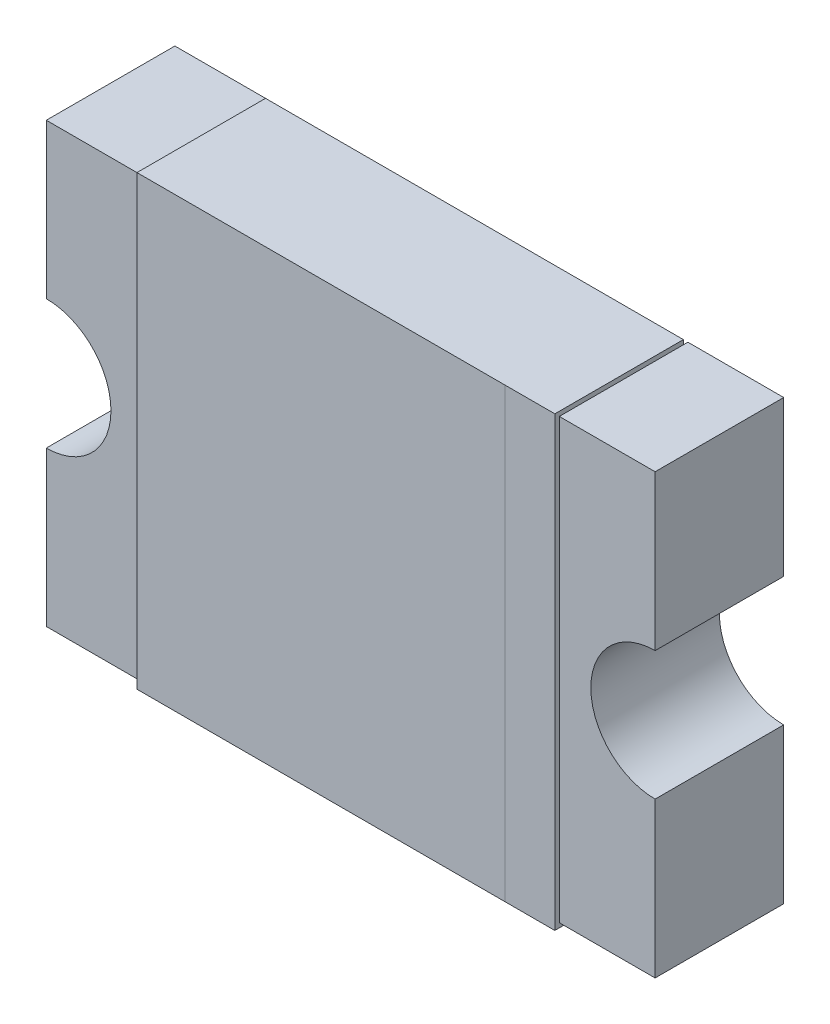
ISO-10303-21;
HEADER;
FILE_DESCRIPTION(('STEP AP214'),'2;1');
FILE_NAME('part.step','',(''),(''),'','','');
FILE_SCHEMA(('AUTOMOTIVE_DESIGN { 1 0 10303 214 1 1 1 1 }'));
ENDSEC;
DATA;
#1=APPLICATION_CONTEXT('core data for automotive mechanical design processes');
#2=APPLICATION_PROTOCOL_DEFINITION('international standard','automotive_design',2000,#1);
#3=PRODUCT_CONTEXT('',#1,'mechanical');
#4=PRODUCT('Part','Part','',(#3));
#5=PRODUCT_RELATED_PRODUCT_CATEGORY('part','',(#4));
#6=PRODUCT_DEFINITION_FORMATION('','',#4);
#7=PRODUCT_DEFINITION_CONTEXT('part definition',#1,'design');
#8=PRODUCT_DEFINITION('design','',#6,#7);
#9=PRODUCT_DEFINITION_SHAPE('','',#8);
#10=(LENGTH_UNIT() NAMED_UNIT(*) SI_UNIT(.MILLI.,.METRE.));
#11=(NAMED_UNIT(*) PLANE_ANGLE_UNIT() SI_UNIT($,.RADIAN.));
#12=(NAMED_UNIT(*) SI_UNIT($,.STERADIAN.) SOLID_ANGLE_UNIT());
#13=UNCERTAINTY_MEASURE_WITH_UNIT(LENGTH_MEASURE(1.E-05),#10,'distance_accuracy_value','');
#14=(GEOMETRIC_REPRESENTATION_CONTEXT(3) GLOBAL_UNCERTAINTY_ASSIGNED_CONTEXT((#13)) GLOBAL_UNIT_ASSIGNED_CONTEXT((#10,
#11,#12)) REPRESENTATION_CONTEXT('',''));
#15=CARTESIAN_POINT('',(0.,0.,0.));
#16=DIRECTION('',(0.,0.,1.));
#17=DIRECTION('',(1.,0.,0.));
#18=AXIS2_PLACEMENT_3D('',#15,#16,#17);
#19=CARTESIAN_POINT('',(-2.365,-1.705,0.));
#20=DIRECTION('',(0.,0.,1.));
#21=DIRECTION('',(1.,0.,0.));
#22=AXIS2_PLACEMENT_3D('',#19,#20,#21);
#23=PLANE('',#22);
#24=DIRECTION('',(-1.,0.,0.));
#25=VECTOR('',#24,1.);
#26=CARTESIAN_POINT('',(-2.365,1.705,0.));
#27=LINE('',#26,#25);
#28=CARTESIAN_POINT('',(-1.625,1.705,0.));
#29=VERTEX_POINT('',#28);
#30=CARTESIAN_POINT('',(-2.365,1.705,0.));
#31=VERTEX_POINT('',#30);
#32=EDGE_CURVE('E299',#29,#31,#27,.T.);
#33=ORIENTED_EDGE('',*,*,#32,.F.);
#34=DIRECTION('',(0.,1.,0.));
#35=VECTOR('',#34,1.);
#36=CARTESIAN_POINT('',(-1.625,-1.74,0.));
#37=LINE('',#36,#35);
#38=CARTESIAN_POINT('',(-1.625,-1.705,0.));
#39=VERTEX_POINT('',#38);
#40=EDGE_CURVE('E244',#39,#29,#37,.T.);
#41=ORIENTED_EDGE('',*,*,#40,.F.);
#42=DIRECTION('',(1.,0.,0.));
#43=VECTOR('',#42,1.);
#44=CARTESIAN_POINT('',(-2.365,-1.705,0.));
#45=LINE('',#44,#43);
#46=CARTESIAN_POINT('',(-2.365,-1.705,0.));
#47=VERTEX_POINT('',#46);
#48=EDGE_CURVE('E293',#47,#39,#45,.T.);
#49=ORIENTED_EDGE('',*,*,#48,.F.);
#50=DIRECTION('',(0.,-1.,0.));
#51=VECTOR('',#50,1.);
#52=CARTESIAN_POINT('',(-2.365,1.705,0.));
#53=LINE('',#52,#51);
#54=CARTESIAN_POINT('',(-2.365,-0.502851750543756,0.));
#55=VERTEX_POINT('',#54);
#56=EDGE_CURVE('E287',#55,#47,#53,.T.);
#57=ORIENTED_EDGE('',*,*,#56,.F.);
#58=CARTESIAN_POINT('',(-2.365,0.,0.));
#59=DIRECTION('',(0.,0.,1.));
#60=DIRECTION('',(1.,0.,0.));
#61=AXIS2_PLACEMENT_3D('',#58,#59,#60);
#62=CIRCLE('',#61,0.502851750543758);
#63=CARTESIAN_POINT('',(-2.365,0.502851750543758,0.));
#64=VERTEX_POINT('',#63);
#65=EDGE_CURVE('E338',#55,#64,#62,.T.);
#66=ORIENTED_EDGE('',*,*,#65,.T.);
#67=EDGE_CURVE('E284',#31,#64,#53,.T.);
#68=ORIENTED_EDGE('',*,*,#67,.F.);
#69=EDGE_LOOP('',(#33,#41,#49,#57,#66,#68));
#70=FACE_BOUND('',#69,.T.);
#71=ADVANCED_FACE('F36',(#70),#23,.F.);
#72=CARTESIAN_POINT('',(1.625,1.705,1.035));
#73=DIRECTION('',(-1.,0.,0.));
#74=DIRECTION('',(0.,-1.,0.));
#75=AXIS2_PLACEMENT_3D('',#72,#73,#74);
#76=PLANE('',#75);
#77=DIRECTION('',(0.,0.,-1.));
#78=VECTOR('',#77,1.);
#79=CARTESIAN_POINT('',(1.625,1.74,1.035));
#80=LINE('',#79,#78);
#81=CARTESIAN_POINT('',(1.625,1.74,1.0349));
#82=VERTEX_POINT('',#81);
#83=CARTESIAN_POINT('',(1.625,1.74,0.0349999999999999));
#84=VERTEX_POINT('',#83);
#85=EDGE_CURVE('E194',#82,#84,#80,.T.);
#86=ORIENTED_EDGE('',*,*,#85,.F.);
#87=DIRECTION('',(0.,1.,0.));
#88=VECTOR('',#87,1.);
#89=CARTESIAN_POINT('',(1.625,1.74,1.0349));
#90=LINE('',#89,#88);
#91=CARTESIAN_POINT('',(1.625,-1.74,1.0349));
#92=VERTEX_POINT('',#91);
#93=EDGE_CURVE('E177',#92,#82,#90,.T.);
#94=ORIENTED_EDGE('',*,*,#93,.F.);
#95=DIRECTION('',(0.,0.,1.));
#96=VECTOR('',#95,1.);
#97=CARTESIAN_POINT('',(1.625,-1.74,1.035));
#98=LINE('',#97,#96);
#99=CARTESIAN_POINT('',(1.625,-1.74,0.0350000000000001));
#100=VERTEX_POINT('',#99);
#101=EDGE_CURVE('E374',#100,#92,#98,.T.);
#102=ORIENTED_EDGE('',*,*,#101,.F.);
#103=DIRECTION('',(0.,-1.,0.));
#104=VECTOR('',#103,1.);
#105=CARTESIAN_POINT('',(1.625,-1.74,0.0350000000000001));
#106=LINE('',#105,#104);
#107=CARTESIAN_POINT('',(1.625,-1.705,0.0350000000000001));
#108=VERTEX_POINT('',#107);
#109=EDGE_CURVE('E62',#108,#100,#106,.T.);
#110=ORIENTED_EDGE('',*,*,#109,.F.);
#111=DIRECTION('',(0.,0.,1.));
#112=VECTOR('',#111,1.);
#113=CARTESIAN_POINT('',(1.625,-1.705,1.035));
#114=LINE('',#113,#112);
#115=CARTESIAN_POINT('',(1.625,-1.705,1.));
#116=VERTEX_POINT('',#115);
#117=EDGE_CURVE('E40',#108,#116,#114,.T.);
#118=ORIENTED_EDGE('',*,*,#117,.T.);
#119=DIRECTION('',(0.,1.,0.));
#120=VECTOR('',#119,1.);
#121=CARTESIAN_POINT('',(1.625,1.705,1.));
#122=LINE('',#121,#120);
#123=CARTESIAN_POINT('',(1.625,1.705,1.));
#124=VERTEX_POINT('',#123);
#125=EDGE_CURVE('E203',#116,#124,#122,.T.);
#126=ORIENTED_EDGE('',*,*,#125,.T.);
#127=DIRECTION('',(0.,0.,-1.));
#128=VECTOR('',#127,1.);
#129=CARTESIAN_POINT('',(1.625,1.705,1.035));
#130=LINE('',#129,#128);
#131=CARTESIAN_POINT('',(1.625,1.705,0.0349999999999999));
#132=VERTEX_POINT('',#131);
#133=EDGE_CURVE('E46',#124,#132,#130,.T.);
#134=ORIENTED_EDGE('',*,*,#133,.T.);
#135=EDGE_CURVE('E202',#84,#132,#106,.T.);
#136=ORIENTED_EDGE('',*,*,#135,.F.);
#137=EDGE_LOOP('',(#86,#94,#102,#110,#118,#126,#134,#136));
#138=FACE_BOUND('',#137,.T.);
#139=ADVANCED_FACE('F199',(#138),#76,.F.);
#140=CARTESIAN_POINT('',(-1.625,1.705,1.035));
#141=DIRECTION('',(1.,0.,0.));
#142=DIRECTION('',(0.,1.,0.));
#143=AXIS2_PLACEMENT_3D('',#140,#141,#142);
#144=PLANE('',#143);
#145=DIRECTION('',(0.,1.,0.));
#146=VECTOR('',#145,1.);
#147=CARTESIAN_POINT('',(-1.625,-1.74,0.0350000000000001));
#148=LINE('',#147,#146);
#149=CARTESIAN_POINT('',(-1.625,-1.74,0.0350000000000001));
#150=VERTEX_POINT('',#149);
#151=CARTESIAN_POINT('',(-1.625,-1.705,0.0350000000000001));
#152=VERTEX_POINT('',#151);
#153=EDGE_CURVE('E252',#150,#152,#148,.T.);
#154=ORIENTED_EDGE('',*,*,#153,.F.);
#155=DIRECTION('',(0.,0.,-1.));
#156=VECTOR('',#155,1.);
#157=CARTESIAN_POINT('',(-1.625,-1.74,1.035));
#158=LINE('',#157,#156);
#159=CARTESIAN_POINT('',(-1.625,-1.74,1.035));
#160=VERTEX_POINT('',#159);
#161=EDGE_CURVE('E234',#160,#150,#158,.T.);
#162=ORIENTED_EDGE('',*,*,#161,.F.);
#163=DIRECTION('',(0.,-1.,0.));
#164=VECTOR('',#163,1.);
#165=CARTESIAN_POINT('',(-1.625,1.705,1.035));
#166=LINE('',#165,#164);
#167=CARTESIAN_POINT('',(-1.625,1.74,1.035));
#168=VERTEX_POINT('',#167);
#169=EDGE_CURVE('E341',#168,#160,#166,.T.);
#170=ORIENTED_EDGE('',*,*,#169,.F.);
#171=DIRECTION('',(0.,0.,1.));
#172=VECTOR('',#171,1.);
#173=CARTESIAN_POINT('',(-1.625,1.74,1.035));
#174=LINE('',#173,#172);
#175=CARTESIAN_POINT('',(-1.625,1.74,0.0349999999999999));
#176=VERTEX_POINT('',#175);
#177=EDGE_CURVE('E209',#176,#168,#174,.T.);
#178=ORIENTED_EDGE('',*,*,#177,.F.);
#179=CARTESIAN_POINT('',(-1.625,1.705,0.0349999999999999));
#180=VERTEX_POINT('',#179);
#181=EDGE_CURVE('E250',#180,#176,#148,.T.);
#182=ORIENTED_EDGE('',*,*,#181,.F.);
#183=DIRECTION('',(0.,0.,1.));
#184=VECTOR('',#183,1.);
#185=CARTESIAN_POINT('',(-1.625,1.705,1.035));
#186=LINE('',#185,#184);
#187=CARTESIAN_POINT('',(-1.625,1.705,1.));
#188=VERTEX_POINT('',#187);
#189=EDGE_CURVE('E220',#180,#188,#186,.T.);
#190=ORIENTED_EDGE('',*,*,#189,.T.);
#191=DIRECTION('',(0.,-1.,0.));
#192=VECTOR('',#191,1.);
#193=CARTESIAN_POINT('',(-1.625,1.705,1.));
#194=LINE('',#193,#192);
#195=CARTESIAN_POINT('',(-1.625,-1.705,1.));
#196=VERTEX_POINT('',#195);
#197=EDGE_CURVE('E207',#188,#196,#194,.T.);
#198=ORIENTED_EDGE('',*,*,#197,.T.);
#199=DIRECTION('',(0.,0.,-1.));
#200=VECTOR('',#199,1.);
#201=CARTESIAN_POINT('',(-1.625,-1.705,1.035));
#202=LINE('',#201,#200);
#203=EDGE_CURVE('E11',#196,#152,#202,.T.);
#204=ORIENTED_EDGE('',*,*,#203,.T.);
#205=EDGE_LOOP('',(#154,#162,#170,#178,#182,#190,#198,#204));
#206=FACE_BOUND('',#205,.T.);
#207=ADVANCED_FACE('F256',(#206),#144,.F.);
#208=CARTESIAN_POINT('',(-1.625,1.74,0.));
#209=DIRECTION('',(0.,-1.,0.));
#210=DIRECTION('',(0.,0.,-1.));
#211=AXIS2_PLACEMENT_3D('',#208,#209,#210);
#212=PLANE('',#211);
#213=DIRECTION('',(1.,0.,0.));
#214=VECTOR('',#213,1.);
#215=CARTESIAN_POINT('',(-1.625,1.74,1.035));
#216=LINE('',#215,#214);
#217=CARTESIAN_POINT('',(1.23686777791931,1.74,1.035));
#218=VERTEX_POINT('',#217);
#219=EDGE_CURVE('E204',#168,#218,#216,.T.);
#220=ORIENTED_EDGE('',*,*,#219,.T.);
#221=DIRECTION('',(0.,0.,1.));
#222=VECTOR('',#221,1.);
#223=CARTESIAN_POINT('',(1.23686777791931,1.74,1.0349));
#224=LINE('',#223,#222);
#225=CARTESIAN_POINT('',(1.23686777791931,1.74,1.0349));
#226=VERTEX_POINT('',#225);
#227=EDGE_CURVE('E54',#226,#218,#224,.T.);
#228=ORIENTED_EDGE('',*,*,#227,.F.);
#229=DIRECTION('',(-1.,0.,0.));
#230=VECTOR('',#229,1.);
#231=CARTESIAN_POINT('',(1.625,1.74,1.0349));
#232=LINE('',#231,#230);
#233=EDGE_CURVE('E181',#82,#226,#232,.T.);
#234=ORIENTED_EDGE('',*,*,#233,.F.);
#235=ORIENTED_EDGE('',*,*,#85,.T.);
#236=DIRECTION('',(1.,0.,0.));
#237=VECTOR('',#236,1.);
#238=CARTESIAN_POINT('',(-1.625,1.74,0.0349999999999999));
#239=LINE('',#238,#237);
#240=EDGE_CURVE('E386',#176,#84,#239,.T.);
#241=ORIENTED_EDGE('',*,*,#240,.F.);
#242=ORIENTED_EDGE('',*,*,#177,.T.);
#243=EDGE_LOOP('',(#220,#228,#234,#235,#241,#242));
#244=FACE_BOUND('',#243,.T.);
#245=ADVANCED_FACE('F192',(#244),#212,.F.);
#246=CARTESIAN_POINT('',(-1.625,-1.74,0.));
#247=DIRECTION('',(0.,-1.,0.));
#248=DIRECTION('',(0.,0.,-1.));
#249=AXIS2_PLACEMENT_3D('',#246,#247,#248);
#250=PLANE('',#249);
#251=DIRECTION('',(0.,0.,1.));
#252=VECTOR('',#251,1.);
#253=CARTESIAN_POINT('',(1.23686777791931,-1.74,1.0349));
#254=LINE('',#253,#252);
#255=CARTESIAN_POINT('',(1.23686777791931,-1.74,1.0349));
#256=VERTEX_POINT('',#255);
#257=CARTESIAN_POINT('',(1.23686777791931,-1.74,1.035));
#258=VERTEX_POINT('',#257);
#259=EDGE_CURVE('E378',#256,#258,#254,.T.);
#260=ORIENTED_EDGE('',*,*,#259,.T.);
#261=DIRECTION('',(-1.,0.,0.));
#262=VECTOR('',#261,1.);
#263=CARTESIAN_POINT('',(-1.625,-1.74,1.035));
#264=LINE('',#263,#262);
#265=EDGE_CURVE('E221',#258,#160,#264,.T.);
#266=ORIENTED_EDGE('',*,*,#265,.T.);
#267=ORIENTED_EDGE('',*,*,#161,.T.);
#268=DIRECTION('',(-1.,0.,0.));
#269=VECTOR('',#268,1.);
#270=CARTESIAN_POINT('',(-1.625,-1.74,0.0350000000000001));
#271=LINE('',#270,#269);
#272=EDGE_CURVE('E366',#100,#150,#271,.T.);
#273=ORIENTED_EDGE('',*,*,#272,.F.);
#274=ORIENTED_EDGE('',*,*,#101,.T.);
#275=DIRECTION('',(1.,0.,0.));
#276=VECTOR('',#275,1.);
#277=CARTESIAN_POINT('',(1.625,-1.74,1.0349));
#278=LINE('',#277,#276);
#279=EDGE_CURVE('E183',#256,#92,#278,.T.);
#280=ORIENTED_EDGE('',*,*,#279,.F.);
#281=EDGE_LOOP('',(#260,#266,#267,#273,#274,#280));
#282=FACE_BOUND('',#281,.T.);
#283=ADVANCED_FACE('F377',(#282),#250,.T.);
#284=CARTESIAN_POINT('',(-2.365,-1.705,1.));
#285=DIRECTION('',(0.,1.,0.));
#286=DIRECTION('',(0.,0.,1.));
#287=AXIS2_PLACEMENT_3D('',#284,#285,#286);
#288=PLANE('',#287);
#289=ORIENTED_EDGE('',*,*,#203,.F.);
#290=DIRECTION('',(1.,0.,0.));
#291=VECTOR('',#290,1.);
#292=CARTESIAN_POINT('',(-2.365,-1.705,1.));
#293=LINE('',#292,#291);
#294=CARTESIAN_POINT('',(-2.365,-1.705,1.));
#295=VERTEX_POINT('',#294);
#296=EDGE_CURVE('E322',#295,#196,#293,.T.);
#297=ORIENTED_EDGE('',*,*,#296,.F.);
#298=DIRECTION('',(0.,0.,-1.));
#299=VECTOR('',#298,1.);
#300=CARTESIAN_POINT('',(-2.365,-1.705,1.));
#301=LINE('',#300,#299);
#302=EDGE_CURVE('E312',#295,#47,#301,.T.);
#303=ORIENTED_EDGE('',*,*,#302,.T.);
#304=ORIENTED_EDGE('',*,*,#48,.T.);
#305=DIRECTION('',(0.,0.,1.));
#306=VECTOR('',#305,1.);
#307=CARTESIAN_POINT('',(-1.625,-1.705,1.));
#308=LINE('',#307,#306);
#309=EDGE_CURVE('E362',#39,#152,#308,.T.);
#310=ORIENTED_EDGE('',*,*,#309,.T.);
#311=EDGE_LOOP('',(#289,#297,#303,#304,#310));
#312=FACE_BOUND('',#311,.T.);
#313=ADVANCED_FACE('F357',(#312),#288,.F.);
#314=CARTESIAN_POINT('',(1.625,-1.705,0.));
#315=VERTEX_POINT('',#314);
#316=EDGE_CURVE('E232',#315,#108,#114,.T.);
#317=ORIENTED_EDGE('',*,*,#316,.F.);
#318=CARTESIAN_POINT('',(2.37,-1.705,0.));
#319=VERTEX_POINT('',#318);
#320=EDGE_CURVE('E224',#315,#319,#45,.T.);
#321=ORIENTED_EDGE('',*,*,#320,.T.);
#322=DIRECTION('',(0.,0.,-1.));
#323=VECTOR('',#322,1.);
#324=CARTESIAN_POINT('',(2.37,-1.705,1.));
#325=LINE('',#324,#323);
#326=CARTESIAN_POINT('',(2.37,-1.705,1.));
#327=VERTEX_POINT('',#326);
#328=EDGE_CURVE('E309',#327,#319,#325,.T.);
#329=ORIENTED_EDGE('',*,*,#328,.F.);
#330=EDGE_CURVE('E324',#116,#327,#293,.T.);
#331=ORIENTED_EDGE('',*,*,#330,.F.);
#332=ORIENTED_EDGE('',*,*,#117,.F.);
#333=EDGE_LOOP('',(#317,#321,#329,#331,#332));
#334=FACE_BOUND('',#333,.T.);
#335=ADVANCED_FACE('F406',(#334),#288,.F.);
#336=CARTESIAN_POINT('',(-2.365,1.705,1.));
#337=DIRECTION('',(0.,-1.,0.));
#338=DIRECTION('',(0.,0.,-1.));
#339=AXIS2_PLACEMENT_3D('',#336,#337,#338);
#340=PLANE('',#339);
#341=EDGE_CURVE('E218',#29,#180,#186,.T.);
#342=ORIENTED_EDGE('',*,*,#341,.F.);
#343=ORIENTED_EDGE('',*,*,#32,.T.);
#344=DIRECTION('',(0.,0.,-1.));
#345=VECTOR('',#344,1.);
#346=CARTESIAN_POINT('',(-2.365,1.705,1.));
#347=LINE('',#346,#345);
#348=CARTESIAN_POINT('',(-2.365,1.705,1.));
#349=VERTEX_POINT('',#348);
#350=EDGE_CURVE('E265',#349,#31,#347,.T.);
#351=ORIENTED_EDGE('',*,*,#350,.F.);
#352=DIRECTION('',(-1.,0.,0.));
#353=VECTOR('',#352,1.);
#354=CARTESIAN_POINT('',(-2.365,1.705,1.));
#355=LINE('',#354,#353);
#356=EDGE_CURVE('E263',#188,#349,#355,.T.);
#357=ORIENTED_EDGE('',*,*,#356,.F.);
#358=ORIENTED_EDGE('',*,*,#189,.F.);
#359=EDGE_LOOP('',(#342,#343,#351,#357,#358));
#360=FACE_BOUND('',#359,.T.);
#361=ADVANCED_FACE('F261',(#360),#340,.F.);
#362=ORIENTED_EDGE('',*,*,#133,.F.);
#363=CARTESIAN_POINT('',(2.37,1.705,1.));
#364=VERTEX_POINT('',#363);
#365=EDGE_CURVE('E269',#364,#124,#355,.T.);
#366=ORIENTED_EDGE('',*,*,#365,.F.);
#367=DIRECTION('',(0.,0.,-1.));
#368=VECTOR('',#367,1.);
#369=CARTESIAN_POINT('',(2.37,1.705,1.));
#370=LINE('',#369,#368);
#371=CARTESIAN_POINT('',(2.37,1.705,0.));
#372=VERTEX_POINT('',#371);
#373=EDGE_CURVE('E306',#364,#372,#370,.T.);
#374=ORIENTED_EDGE('',*,*,#373,.T.);
#375=CARTESIAN_POINT('',(1.625,1.705,0.));
#376=VERTEX_POINT('',#375);
#377=EDGE_CURVE('E301',#372,#376,#27,.T.);
#378=ORIENTED_EDGE('',*,*,#377,.T.);
#379=DIRECTION('',(0.,0.,1.));
#380=VECTOR('',#379,1.);
#381=CARTESIAN_POINT('',(1.625,1.705,1.));
#382=LINE('',#381,#380);
#383=EDGE_CURVE('E363',#376,#132,#382,.T.);
#384=ORIENTED_EDGE('',*,*,#383,.T.);
#385=EDGE_LOOP('',(#362,#366,#374,#378,#384));
#386=FACE_BOUND('',#385,.T.);
#387=ADVANCED_FACE('F423',(#386),#340,.F.);
#388=CARTESIAN_POINT('',(-2.365,-1.705,1.));
#389=DIRECTION('',(0.,0.,1.));
#390=DIRECTION('',(1.,0.,0.));
#391=AXIS2_PLACEMENT_3D('',#388,#389,#390);
#392=PLANE('',#391);
#393=ORIENTED_EDGE('',*,*,#125,.F.);
#394=ORIENTED_EDGE('',*,*,#330,.T.);
#395=DIRECTION('',(0.,1.,0.));
#396=VECTOR('',#395,1.);
#397=CARTESIAN_POINT('',(2.37,1.705,1.));
#398=LINE('',#397,#396);
#399=CARTESIAN_POINT('',(2.37,-0.500000000000001,1.));
#400=VERTEX_POINT('',#399);
#401=EDGE_CURVE('E270',#327,#400,#398,.T.);
#402=ORIENTED_EDGE('',*,*,#401,.T.);
#403=CARTESIAN_POINT('',(2.37,0.,1.));
#404=DIRECTION('',(0.,0.,-1.));
#405=DIRECTION('',(0.,1.,0.));
#406=AXIS2_PLACEMENT_3D('',#403,#404,#405);
#407=CIRCLE('',#406,0.5);
#408=CARTESIAN_POINT('',(2.37,0.499999999999999,1.));
#409=VERTEX_POINT('',#408);
#410=EDGE_CURVE('E335',#400,#409,#407,.T.);
#411=ORIENTED_EDGE('',*,*,#410,.T.);
#412=EDGE_CURVE('E275',#409,#364,#398,.T.);
#413=ORIENTED_EDGE('',*,*,#412,.T.);
#414=ORIENTED_EDGE('',*,*,#365,.T.);
#415=EDGE_LOOP('',(#393,#394,#402,#411,#413,#414));
#416=FACE_BOUND('',#415,.T.);
#417=ADVANCED_FACE('F426',(#416),#392,.T.);
#418=CARTESIAN_POINT('',(-2.365,1.705,1.));
#419=DIRECTION('',(1.,0.,0.));
#420=DIRECTION('',(0.,1.,0.));
#421=AXIS2_PLACEMENT_3D('',#418,#419,#420);
#422=PLANE('',#421);
#423=ORIENTED_EDGE('',*,*,#67,.T.);
#424=DIRECTION('',(0.,0.,1.));
#425=VECTOR('',#424,1.);
#426=CARTESIAN_POINT('',(-2.365,0.502851750543758,0.));
#427=LINE('',#426,#425);
#428=CARTESIAN_POINT('',(-2.365,0.502851750543758,1.));
#429=VERTEX_POINT('',#428);
#430=EDGE_CURVE('E298',#64,#429,#427,.T.);
#431=ORIENTED_EDGE('',*,*,#430,.T.);
#432=DIRECTION('',(0.,-1.,0.));
#433=VECTOR('',#432,1.);
#434=CARTESIAN_POINT('',(-2.365,1.705,1.));
#435=LINE('',#434,#433);
#436=EDGE_CURVE('E327',#349,#429,#435,.T.);
#437=ORIENTED_EDGE('',*,*,#436,.F.);
#438=ORIENTED_EDGE('',*,*,#350,.T.);
#439=EDGE_LOOP('',(#423,#431,#437,#438));
#440=FACE_BOUND('',#439,.T.);
#441=ADVANCED_FACE('F432',(#440),#422,.F.);
#442=CARTESIAN_POINT('',(2.37,1.705,1.));
#443=DIRECTION('',(-1.,0.,0.));
#444=DIRECTION('',(0.,-1.,0.));
#445=AXIS2_PLACEMENT_3D('',#442,#443,#444);
#446=PLANE('',#445);
#447=DIRECTION('',(0.,0.,1.));
#448=VECTOR('',#447,1.);
#449=CARTESIAN_POINT('',(2.37,-0.500000000000001,0.));
#450=LINE('',#449,#448);
#451=CARTESIAN_POINT('',(2.37,-0.500000000000001,0.));
#452=VERTEX_POINT('',#451);
#453=EDGE_CURVE('E331',#400,#452,#450,.F.);
#454=ORIENTED_EDGE('',*,*,#453,.F.);
#455=ORIENTED_EDGE('',*,*,#401,.F.);
#456=ORIENTED_EDGE('',*,*,#328,.T.);
#457=DIRECTION('',(0.,1.,0.));
#458=VECTOR('',#457,1.);
#459=CARTESIAN_POINT('',(2.37,1.705,0.));
#460=LINE('',#459,#458);
#461=EDGE_CURVE('E290',#319,#452,#460,.T.);
#462=ORIENTED_EDGE('',*,*,#461,.T.);
#463=EDGE_LOOP('',(#454,#455,#456,#462));
#464=FACE_BOUND('',#463,.T.);
#465=ADVANCED_FACE('F430',(#464),#446,.F.);
#466=DIRECTION('',(0.,0.,1.));
#467=VECTOR('',#466,1.);
#468=CARTESIAN_POINT('',(2.37,0.499999999999999,0.));
#469=LINE('',#468,#467);
#470=CARTESIAN_POINT('',(2.37,0.499999999999999,0.));
#471=VERTEX_POINT('',#470);
#472=EDGE_CURVE('E333',#471,#409,#469,.T.);
#473=ORIENTED_EDGE('',*,*,#472,.F.);
#474=EDGE_CURVE('E296',#471,#372,#460,.T.);
#475=ORIENTED_EDGE('',*,*,#474,.T.);
#476=ORIENTED_EDGE('',*,*,#373,.F.);
#477=ORIENTED_EDGE('',*,*,#412,.F.);
#478=EDGE_LOOP('',(#473,#475,#476,#477));
#479=FACE_BOUND('',#478,.T.);
#480=ADVANCED_FACE('F419',(#479),#446,.F.);
#481=ORIENTED_EDGE('',*,*,#197,.F.);
#482=ORIENTED_EDGE('',*,*,#356,.T.);
#483=ORIENTED_EDGE('',*,*,#436,.T.);
#484=CARTESIAN_POINT('',(-2.365,0.,1.));
#485=DIRECTION('',(0.,0.,1.));
#486=DIRECTION('',(1.,0.,0.));
#487=AXIS2_PLACEMENT_3D('',#484,#485,#486);
#488=CIRCLE('',#487,0.502851750543758);
#489=CARTESIAN_POINT('',(-2.365,-0.502851750543757,1.));
#490=VERTEX_POINT('',#489);
#491=EDGE_CURVE('E339',#490,#429,#488,.T.);
#492=ORIENTED_EDGE('',*,*,#491,.F.);
#493=EDGE_CURVE('E330',#490,#295,#435,.T.);
#494=ORIENTED_EDGE('',*,*,#493,.T.);
#495=ORIENTED_EDGE('',*,*,#296,.T.);
#496=EDGE_LOOP('',(#481,#482,#483,#492,#494,#495));
#497=FACE_BOUND('',#496,.T.);
#498=ADVANCED_FACE('F351',(#497),#392,.T.);
#499=ORIENTED_EDGE('',*,*,#320,.F.);
#500=DIRECTION('',(0.,-1.,0.));
#501=VECTOR('',#500,1.);
#502=CARTESIAN_POINT('',(1.625,-1.74,0.));
#503=LINE('',#502,#501);
#504=EDGE_CURVE('E259',#376,#315,#503,.T.);
#505=ORIENTED_EDGE('',*,*,#504,.F.);
#506=ORIENTED_EDGE('',*,*,#377,.F.);
#507=ORIENTED_EDGE('',*,*,#474,.F.);
#508=CARTESIAN_POINT('',(2.37,0.,0.));
#509=DIRECTION('',(0.,0.,1.));
#510=DIRECTION('',(1.,0.,0.));
#511=AXIS2_PLACEMENT_3D('',#508,#509,#510);
#512=CIRCLE('',#511,0.5);
#513=EDGE_CURVE('E315',#452,#471,#512,.F.);
#514=ORIENTED_EDGE('',*,*,#513,.F.);
#515=ORIENTED_EDGE('',*,*,#461,.F.);
#516=EDGE_LOOP('',(#499,#505,#506,#507,#514,#515));
#517=FACE_BOUND('',#516,.T.);
#518=ADVANCED_FACE('F410',(#517),#23,.F.);
#519=ORIENTED_EDGE('',*,*,#493,.F.);
#520=DIRECTION('',(0.,0.,1.));
#521=VECTOR('',#520,1.);
#522=CARTESIAN_POINT('',(-2.365,-0.502851750543757,0.));
#523=LINE('',#522,#521);
#524=EDGE_CURVE('E317',#490,#55,#523,.F.);
#525=ORIENTED_EDGE('',*,*,#524,.T.);
#526=ORIENTED_EDGE('',*,*,#56,.T.);
#527=ORIENTED_EDGE('',*,*,#302,.F.);
#528=EDGE_LOOP('',(#519,#525,#526,#527));
#529=FACE_BOUND('',#528,.T.);
#530=ADVANCED_FACE('F38',(#529),#422,.F.);
#531=CARTESIAN_POINT('',(2.37,0.,0.));
#532=DIRECTION('',(0.,0.,1.));
#533=DIRECTION('',(0.,-1.,0.));
#534=AXIS2_PLACEMENT_3D('',#531,#532,#533);
#535=CYLINDRICAL_SURFACE('',#534,0.5);
#536=ORIENTED_EDGE('',*,*,#453,.T.);
#537=ORIENTED_EDGE('',*,*,#513,.T.);
#538=ORIENTED_EDGE('',*,*,#472,.T.);
#539=ORIENTED_EDGE('',*,*,#410,.F.);
#540=EDGE_LOOP('',(#536,#537,#538,#539));
#541=FACE_BOUND('',#540,.T.);
#542=ADVANCED_FACE('F429',(#541),#535,.F.);
#543=CARTESIAN_POINT('',(-2.365,0.,0.));
#544=DIRECTION('',(0.,0.,1.));
#545=DIRECTION('',(1.,0.,0.));
#546=AXIS2_PLACEMENT_3D('',#543,#544,#545);
#547=CYLINDRICAL_SURFACE('',#546,0.502851750543758);
#548=ORIENTED_EDGE('',*,*,#65,.F.);
#549=ORIENTED_EDGE('',*,*,#524,.F.);
#550=ORIENTED_EDGE('',*,*,#491,.T.);
#551=ORIENTED_EDGE('',*,*,#430,.F.);
#552=EDGE_LOOP('',(#548,#549,#550,#551));
#553=FACE_BOUND('',#552,.T.);
#554=ADVANCED_FACE('F481',(#553),#547,.F.);
#555=CARTESIAN_POINT('',(1.625,1.705,1.035));
#556=DIRECTION('',(0.,0.,-1.));
#557=DIRECTION('',(-1.,0.,0.));
#558=AXIS2_PLACEMENT_3D('',#555,#556,#557);
#559=PLANE('',#558);
#560=ORIENTED_EDGE('',*,*,#265,.F.);
#561=DIRECTION('',(0.,-1.,0.));
#562=VECTOR('',#561,1.);
#563=CARTESIAN_POINT('',(1.23686777791931,1.74,1.035));
#564=LINE('',#563,#562);
#565=EDGE_CURVE('E188',#218,#258,#564,.T.);
#566=ORIENTED_EDGE('',*,*,#565,.F.);
#567=ORIENTED_EDGE('',*,*,#219,.F.);
#568=ORIENTED_EDGE('',*,*,#169,.T.);
#569=EDGE_LOOP('',(#560,#566,#567,#568));
#570=FACE_BOUND('',#569,.T.);
#571=ADVANCED_FACE('F379',(#570),#559,.F.);
#572=CARTESIAN_POINT('',(-1.625,-1.74,0.0350000000000001));
#573=DIRECTION('',(-1.,0.,0.));
#574=DIRECTION('',(0.,0.,1.));
#575=AXIS2_PLACEMENT_3D('',#572,#573,#574);
#576=PLANE('',#575);
#577=ORIENTED_EDGE('',*,*,#40,.T.);
#578=ORIENTED_EDGE('',*,*,#341,.T.);
#579=EDGE_CURVE('E241',#152,#180,#148,.T.);
#580=ORIENTED_EDGE('',*,*,#579,.F.);
#581=ORIENTED_EDGE('',*,*,#309,.F.);
#582=EDGE_LOOP('',(#577,#578,#580,#581));
#583=FACE_BOUND('',#582,.T.);
#584=ADVANCED_FACE('F240',(#583),#576,.F.);
#585=CARTESIAN_POINT('',(1.625,-1.74,0.0350000000000001));
#586=DIRECTION('',(1.,0.,0.));
#587=DIRECTION('',(0.,0.,-1.));
#588=AXIS2_PLACEMENT_3D('',#585,#586,#587);
#589=PLANE('',#588);
#590=EDGE_CURVE('E389',#132,#108,#106,.T.);
#591=ORIENTED_EDGE('',*,*,#590,.F.);
#592=ORIENTED_EDGE('',*,*,#383,.F.);
#593=ORIENTED_EDGE('',*,*,#504,.T.);
#594=ORIENTED_EDGE('',*,*,#316,.T.);
#595=EDGE_LOOP('',(#591,#592,#593,#594));
#596=FACE_BOUND('',#595,.T.);
#597=ADVANCED_FACE('F399',(#596),#589,.F.);
#598=CARTESIAN_POINT('',(-1.625,1.74,0.0349999999999999));
#599=DIRECTION('',(0.,0.,-1.));
#600=DIRECTION('',(0.,1.,0.));
#601=AXIS2_PLACEMENT_3D('',#598,#599,#600);
#602=PLANE('',#601);
#603=ORIENTED_EDGE('',*,*,#153,.T.);
#604=ORIENTED_EDGE('',*,*,#579,.T.);
#605=ORIENTED_EDGE('',*,*,#181,.T.);
#606=ORIENTED_EDGE('',*,*,#240,.T.);
#607=ORIENTED_EDGE('',*,*,#135,.T.);
#608=ORIENTED_EDGE('',*,*,#590,.T.);
#609=ORIENTED_EDGE('',*,*,#109,.T.);
#610=ORIENTED_EDGE('',*,*,#272,.T.);
#611=EDGE_LOOP('',(#603,#604,#605,#606,#607,#608,#609,#610));
#612=FACE_BOUND('',#611,.T.);
#613=ADVANCED_FACE('F249',(#612),#602,.T.);
#614=CARTESIAN_POINT('',(1.23686777791931,1.74,1.0349));
#615=DIRECTION('',(-1.,0.,0.));
#616=DIRECTION('',(0.,0.,1.));
#617=AXIS2_PLACEMENT_3D('',#614,#615,#616);
#618=PLANE('',#617);
#619=ORIENTED_EDGE('',*,*,#565,.T.);
#620=ORIENTED_EDGE('',*,*,#259,.F.);
#621=DIRECTION('',(0.,-1.,0.));
#622=VECTOR('',#621,1.);
#623=CARTESIAN_POINT('',(1.23686777791931,1.74,1.0349));
#624=LINE('',#623,#622);
#625=EDGE_CURVE('E196',#226,#256,#624,.T.);
#626=ORIENTED_EDGE('',*,*,#625,.F.);
#627=ORIENTED_EDGE('',*,*,#227,.T.);
#628=EDGE_LOOP('',(#619,#620,#626,#627));
#629=FACE_BOUND('',#628,.T.);
#630=ADVANCED_FACE('F518',(#629),#618,.F.);
#631=CARTESIAN_POINT('',(1.625,-1.74,1.0349));
#632=DIRECTION('',(0.,0.,-1.));
#633=DIRECTION('',(-1.,0.,0.));
#634=AXIS2_PLACEMENT_3D('',#631,#632,#633);
#635=PLANE('',#634);
#636=ORIENTED_EDGE('',*,*,#93,.T.);
#637=ORIENTED_EDGE('',*,*,#233,.T.);
#638=ORIENTED_EDGE('',*,*,#625,.T.);
#639=ORIENTED_EDGE('',*,*,#279,.T.);
#640=EDGE_LOOP('',(#636,#637,#638,#639));
#641=FACE_BOUND('',#640,.T.);
#642=ADVANCED_FACE('F179',(#641),#635,.F.);
#643=CLOSED_SHELL('',(#71,#139,#207,#245,#283,#313,#335,#361,#387,#417,#441,#465,#480,#498,#518,
#530,#542,#554,#571,#584,#597,#613,#630,#642));
#644=MANIFOLD_SOLID_BREP('B2',#643);
#645=ADVANCED_BREP_SHAPE_REPRESENTATION('',(#18,#644),#14);
#646=SHAPE_DEFINITION_REPRESENTATION(#9,#645);
ENDSEC;
END-ISO-10303-21;
